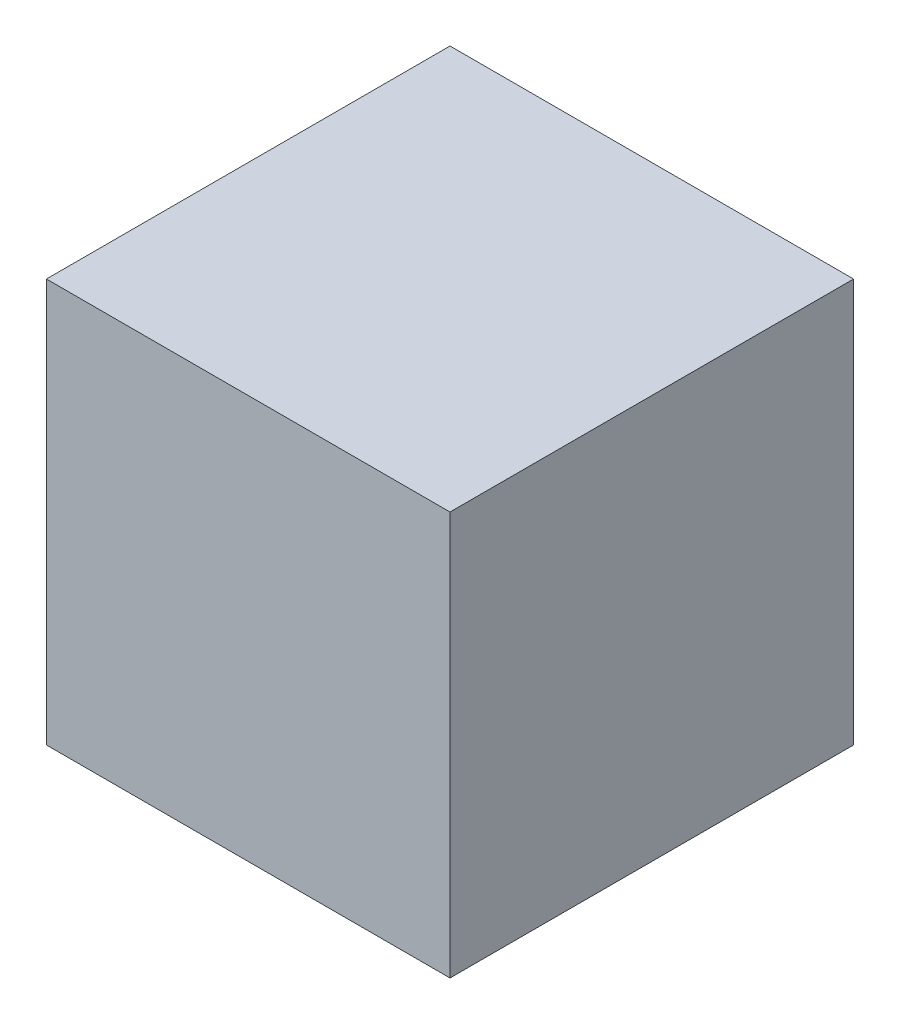
ISO-10303-21;
HEADER;
FILE_DESCRIPTION(('STEP AP214'),'2;1');
FILE_NAME('part.step','',(''),(''),'','','');
FILE_SCHEMA(('AUTOMOTIVE_DESIGN { 1 0 10303 214 1 1 1 1 }'));
ENDSEC;
DATA;
#1=APPLICATION_CONTEXT('core data for automotive mechanical design processes');
#2=APPLICATION_PROTOCOL_DEFINITION('international standard','automotive_design',2000,#1);
#3=PRODUCT_CONTEXT('',#1,'mechanical');
#4=PRODUCT('Part','Part','',(#3));
#5=PRODUCT_RELATED_PRODUCT_CATEGORY('part','',(#4));
#6=PRODUCT_DEFINITION_FORMATION('','',#4);
#7=PRODUCT_DEFINITION_CONTEXT('part definition',#1,'design');
#8=PRODUCT_DEFINITION('design','',#6,#7);
#9=PRODUCT_DEFINITION_SHAPE('','',#8);
#10=(LENGTH_UNIT() NAMED_UNIT(*) SI_UNIT(.MILLI.,.METRE.));
#11=(NAMED_UNIT(*) PLANE_ANGLE_UNIT() SI_UNIT($,.RADIAN.));
#12=(NAMED_UNIT(*) SI_UNIT($,.STERADIAN.) SOLID_ANGLE_UNIT());
#13=UNCERTAINTY_MEASURE_WITH_UNIT(LENGTH_MEASURE(1.E-05),#10,'distance_accuracy_value','');
#14=(GEOMETRIC_REPRESENTATION_CONTEXT(3) GLOBAL_UNCERTAINTY_ASSIGNED_CONTEXT((#13)) GLOBAL_UNIT_ASSIGNED_CONTEXT((#10,
#11,#12)) REPRESENTATION_CONTEXT('',''));
#15=CARTESIAN_POINT('',(0.,0.,0.));
#16=DIRECTION('',(0.,0.,1.));
#17=DIRECTION('',(1.,0.,0.));
#18=AXIS2_PLACEMENT_3D('',#15,#16,#17);
#19=CARTESIAN_POINT('',(0.,50.,0.));
#20=DIRECTION('',(1.,0.,0.));
#21=DIRECTION('',(0.,0.,-1.));
#22=AXIS2_PLACEMENT_3D('',#19,#20,#21);
#23=PLANE('',#22);
#24=DIRECTION('',(0.,0.,1.));
#25=VECTOR('',#24,1.);
#26=CARTESIAN_POINT('',(0.,-50.,0.));
#27=LINE('',#26,#25);
#28=CARTESIAN_POINT('',(0.,-50.,-100.));
#29=VERTEX_POINT('',#28);
#30=CARTESIAN_POINT('',(0.,-50.,0.));
#31=VERTEX_POINT('',#30);
#32=EDGE_CURVE('E98',#29,#31,#27,.T.);
#33=ORIENTED_EDGE('',*,*,#32,.T.);
#34=DIRECTION('',(0.,-1.,0.));
#35=VECTOR('',#34,1.);
#36=CARTESIAN_POINT('',(0.,50.,0.));
#37=LINE('',#36,#35);
#38=CARTESIAN_POINT('',(0.,50.,0.));
#39=VERTEX_POINT('',#38);
#40=EDGE_CURVE('E11',#39,#31,#37,.T.);
#41=ORIENTED_EDGE('',*,*,#40,.F.);
#42=DIRECTION('',(0.,0.,1.));
#43=VECTOR('',#42,1.);
#44=CARTESIAN_POINT('',(0.,50.,0.));
#45=LINE('',#44,#43);
#46=CARTESIAN_POINT('',(0.,50.,-100.));
#47=VERTEX_POINT('',#46);
#48=EDGE_CURVE('E86',#47,#39,#45,.T.);
#49=ORIENTED_EDGE('',*,*,#48,.F.);
#50=DIRECTION('',(0.,-1.,0.));
#51=VECTOR('',#50,1.);
#52=CARTESIAN_POINT('',(0.,50.,-100.));
#53=LINE('',#52,#51);
#54=EDGE_CURVE('E94',#47,#29,#53,.T.);
#55=ORIENTED_EDGE('',*,*,#54,.T.);
#56=EDGE_LOOP('',(#33,#41,#49,#55));
#57=FACE_BOUND('',#56,.T.);
#58=ADVANCED_FACE('F35',(#57),#23,.F.);
#59=CARTESIAN_POINT('',(0.,50.,0.));
#60=DIRECTION('',(0.,0.,-1.));
#61=DIRECTION('',(-1.,0.,0.));
#62=AXIS2_PLACEMENT_3D('',#59,#60,#61);
#63=PLANE('',#62);
#64=DIRECTION('',(1.,0.,0.));
#65=VECTOR('',#64,1.);
#66=CARTESIAN_POINT('',(0.,-50.,0.));
#67=LINE('',#66,#65);
#68=CARTESIAN_POINT('',(100.,-50.,0.));
#69=VERTEX_POINT('',#68);
#70=EDGE_CURVE('E90',#31,#69,#67,.T.);
#71=ORIENTED_EDGE('',*,*,#70,.T.);
#72=DIRECTION('',(0.,-1.,0.));
#73=VECTOR('',#72,1.);
#74=CARTESIAN_POINT('',(100.,50.,0.));
#75=LINE('',#74,#73);
#76=CARTESIAN_POINT('',(100.,50.,0.));
#77=VERTEX_POINT('',#76);
#78=EDGE_CURVE('E43',#77,#69,#75,.T.);
#79=ORIENTED_EDGE('',*,*,#78,.F.);
#80=DIRECTION('',(1.,0.,0.));
#81=VECTOR('',#80,1.);
#82=CARTESIAN_POINT('',(0.,50.,0.));
#83=LINE('',#82,#81);
#84=EDGE_CURVE('E81',#39,#77,#83,.T.);
#85=ORIENTED_EDGE('',*,*,#84,.F.);
#86=ORIENTED_EDGE('',*,*,#40,.T.);
#87=EDGE_LOOP('',(#71,#79,#85,#86));
#88=FACE_BOUND('',#87,.T.);
#89=ADVANCED_FACE('F89',(#88),#63,.F.);
#90=CARTESIAN_POINT('',(100.,50.,0.));
#91=DIRECTION('',(-1.,0.,0.));
#92=DIRECTION('',(0.,0.,1.));
#93=AXIS2_PLACEMENT_3D('',#90,#91,#92);
#94=PLANE('',#93);
#95=DIRECTION('',(0.,0.,-1.));
#96=VECTOR('',#95,1.);
#97=CARTESIAN_POINT('',(100.,-50.,0.));
#98=LINE('',#97,#96);
#99=CARTESIAN_POINT('',(100.,-50.,-100.));
#100=VERTEX_POINT('',#99);
#101=EDGE_CURVE('E68',#69,#100,#98,.T.);
#102=ORIENTED_EDGE('',*,*,#101,.T.);
#103=DIRECTION('',(0.,-1.,0.));
#104=VECTOR('',#103,1.);
#105=CARTESIAN_POINT('',(100.,50.,-100.));
#106=LINE('',#105,#104);
#107=CARTESIAN_POINT('',(100.,50.,-100.));
#108=VERTEX_POINT('',#107);
#109=EDGE_CURVE('E91',#108,#100,#106,.T.);
#110=ORIENTED_EDGE('',*,*,#109,.F.);
#111=DIRECTION('',(0.,0.,-1.));
#112=VECTOR('',#111,1.);
#113=CARTESIAN_POINT('',(100.,50.,0.));
#114=LINE('',#113,#112);
#115=EDGE_CURVE('E84',#77,#108,#114,.T.);
#116=ORIENTED_EDGE('',*,*,#115,.F.);
#117=ORIENTED_EDGE('',*,*,#78,.T.);
#118=EDGE_LOOP('',(#102,#110,#116,#117));
#119=FACE_BOUND('',#118,.T.);
#120=ADVANCED_FACE('F92',(#119),#94,.F.);
#121=CARTESIAN_POINT('',(0.,50.,-100.));
#122=DIRECTION('',(0.,0.,1.));
#123=DIRECTION('',(1.,0.,0.));
#124=AXIS2_PLACEMENT_3D('',#121,#122,#123);
#125=PLANE('',#124);
#126=DIRECTION('',(-1.,0.,0.));
#127=VECTOR('',#126,1.);
#128=CARTESIAN_POINT('',(0.,-50.,-100.));
#129=LINE('',#128,#127);
#130=EDGE_CURVE('E74',#100,#29,#129,.T.);
#131=ORIENTED_EDGE('',*,*,#130,.T.);
#132=ORIENTED_EDGE('',*,*,#54,.F.);
#133=DIRECTION('',(-1.,0.,0.));
#134=VECTOR('',#133,1.);
#135=CARTESIAN_POINT('',(0.,50.,-100.));
#136=LINE('',#135,#134);
#137=EDGE_CURVE('E51',#108,#47,#136,.T.);
#138=ORIENTED_EDGE('',*,*,#137,.F.);
#139=ORIENTED_EDGE('',*,*,#109,.T.);
#140=EDGE_LOOP('',(#131,#132,#138,#139));
#141=FACE_BOUND('',#140,.T.);
#142=ADVANCED_FACE('F105',(#141),#125,.F.);
#143=CARTESIAN_POINT('',(0.,50.,-100.));
#144=DIRECTION('',(0.,-1.,0.));
#145=DIRECTION('',(0.,0.,-1.));
#146=AXIS2_PLACEMENT_3D('',#143,#144,#145);
#147=PLANE('',#146);
#148=ORIENTED_EDGE('',*,*,#48,.T.);
#149=ORIENTED_EDGE('',*,*,#84,.T.);
#150=ORIENTED_EDGE('',*,*,#115,.T.);
#151=ORIENTED_EDGE('',*,*,#137,.T.);
#152=EDGE_LOOP('',(#148,#149,#150,#151));
#153=FACE_BOUND('',#152,.T.);
#154=ADVANCED_FACE('F82',(#153),#147,.F.);
#155=CARTESIAN_POINT('',(0.,-50.,-100.));
#156=DIRECTION('',(0.,-1.,0.));
#157=DIRECTION('',(0.,0.,-1.));
#158=AXIS2_PLACEMENT_3D('',#155,#156,#157);
#159=PLANE('',#158);
#160=ORIENTED_EDGE('',*,*,#32,.F.);
#161=ORIENTED_EDGE('',*,*,#130,.F.);
#162=ORIENTED_EDGE('',*,*,#101,.F.);
#163=ORIENTED_EDGE('',*,*,#70,.F.);
#164=EDGE_LOOP('',(#160,#161,#162,#163));
#165=FACE_BOUND('',#164,.T.);
#166=ADVANCED_FACE('F108',(#165),#159,.T.);
#167=CLOSED_SHELL('',(#58,#89,#120,#142,#154,#166));
#168=MANIFOLD_SOLID_BREP('B2',#167);
#169=ADVANCED_BREP_SHAPE_REPRESENTATION('',(#18,#168),#14);
#170=SHAPE_DEFINITION_REPRESENTATION(#9,#169);
ENDSEC;
END-ISO-10303-21;
